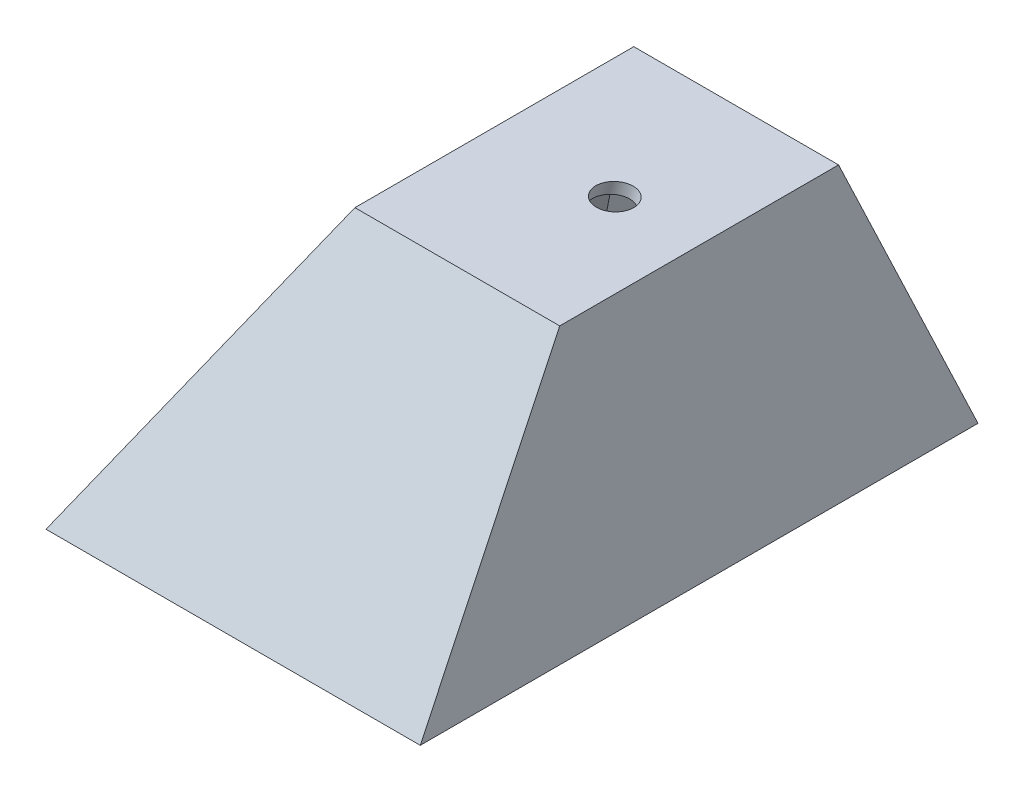
ISO-10303-21;
HEADER;
FILE_DESCRIPTION(('STEP AP214'),'2;1');
FILE_NAME('part.step','',(''),(''),'','','');
FILE_SCHEMA(('AUTOMOTIVE_DESIGN { 1 0 10303 214 1 1 1 1 }'));
ENDSEC;
DATA;
#1=APPLICATION_CONTEXT('core data for automotive mechanical design processes');
#2=APPLICATION_PROTOCOL_DEFINITION('international standard','automotive_design',2000,#1);
#3=PRODUCT_CONTEXT('',#1,'mechanical');
#4=PRODUCT('Part','Part','',(#3));
#5=PRODUCT_RELATED_PRODUCT_CATEGORY('part','',(#4));
#6=PRODUCT_DEFINITION_FORMATION('','',#4);
#7=PRODUCT_DEFINITION_CONTEXT('part definition',#1,'design');
#8=PRODUCT_DEFINITION('design','',#6,#7);
#9=PRODUCT_DEFINITION_SHAPE('','',#8);
#10=(LENGTH_UNIT() NAMED_UNIT(*) SI_UNIT(.MILLI.,.METRE.));
#11=(NAMED_UNIT(*) PLANE_ANGLE_UNIT() SI_UNIT($,.RADIAN.));
#12=(NAMED_UNIT(*) SI_UNIT($,.STERADIAN.) SOLID_ANGLE_UNIT());
#13=UNCERTAINTY_MEASURE_WITH_UNIT(LENGTH_MEASURE(1.E-05),#10,'distance_accuracy_value','');
#14=(GEOMETRIC_REPRESENTATION_CONTEXT(3) GLOBAL_UNCERTAINTY_ASSIGNED_CONTEXT((#13)) GLOBAL_UNIT_ASSIGNED_CONTEXT((#10,
#11,#12)) REPRESENTATION_CONTEXT('',''));
#15=CARTESIAN_POINT('',(0.,0.,0.));
#16=DIRECTION('',(0.,0.,1.));
#17=DIRECTION('',(1.,0.,0.));
#18=AXIS2_PLACEMENT_3D('',#15,#16,#17);
#19=CARTESIAN_POINT('',(0.,7.60993493538792,76.));
#20=DIRECTION('',(0.,-1.,0.));
#21=DIRECTION('',(1.,0.,0.));
#22=AXIS2_PLACEMENT_3D('',#19,#20,#21);
#23=PLANE('',#22);
#24=DIRECTION('',(0.,0.,-1.));
#25=VECTOR('',#24,1.);
#26=CARTESIAN_POINT('',(-16.4117509967115,7.60993493538792,76.));
#27=LINE('',#26,#25);
#28=CARTESIAN_POINT('',(-16.4117509967115,7.60993493538792,57.));
#29=VERTEX_POINT('',#28);
#30=CARTESIAN_POINT('',(-16.4117509967115,7.60993493538792,19.));
#31=VERTEX_POINT('',#30);
#32=EDGE_CURVE('E13',#29,#31,#27,.T.);
#33=ORIENTED_EDGE('',*,*,#32,.F.);
#34=DIRECTION('',(1.,0.,0.));
#35=VECTOR('',#34,1.);
#36=CARTESIAN_POINT('',(-39.5057617642968,7.60993493538793,57.));
#37=LINE('',#36,#35);
#38=CARTESIAN_POINT('',(11.4942382357032,7.60993493538793,57.));
#39=VERTEX_POINT('',#38);
#40=EDGE_CURVE('E155',#29,#39,#37,.T.);
#41=ORIENTED_EDGE('',*,*,#40,.T.);
#42=DIRECTION('',(0.,0.,-1.));
#43=VECTOR('',#42,1.);
#44=CARTESIAN_POINT('',(11.4942382357032,7.60993493538793,76.));
#45=LINE('',#44,#43);
#46=CARTESIAN_POINT('',(11.4942382357032,7.60993493538793,19.));
#47=VERTEX_POINT('',#46);
#48=EDGE_CURVE('E166',#39,#47,#45,.T.);
#49=ORIENTED_EDGE('',*,*,#48,.T.);
#50=DIRECTION('',(1.,0.,0.));
#51=VECTOR('',#50,1.);
#52=CARTESIAN_POINT('',(-39.5057617642968,7.60993493538793,19.));
#53=LINE('',#52,#51);
#54=EDGE_CURVE('E134',#31,#47,#53,.T.);
#55=ORIENTED_EDGE('',*,*,#54,.F.);
#56=EDGE_LOOP('',(#33,#41,#49,#55));
#57=FACE_BOUND('',#56,.T.);
#58=CARTESIAN_POINT('',(0.,7.60993493538793,38.));
#59=DIRECTION('',(0.,-1.,0.));
#60=DIRECTION('',(1.,0.,0.));
#61=AXIS2_PLACEMENT_3D('',#58,#59,#60);
#62=ELLIPSE('',#61,2.58819045102521,2.5);
#63=CARTESIAN_POINT('',(2.58819045102521,7.60993493538793,38.));
#64=VERTEX_POINT('',#63);
#65=EDGE_CURVE('E139',#64,#64,#62,.T.);
#66=ORIENTED_EDGE('',*,*,#65,.T.);
#67=EDGE_LOOP('',(#66));
#68=FACE_BOUND('',#67,.T.);
#69=ADVANCED_FACE('F46',(#57,#68),#23,.F.);
#70=CARTESIAN_POINT('',(0.,-32.3900650646121,76.));
#71=DIRECTION('',(0.,1.,0.));
#72=DIRECTION('',(0.,0.,1.));
#73=AXIS2_PLACEMENT_3D('',#70,#71,#72);
#74=PLANE('',#73);
#75=DIRECTION('',(1.,0.,0.));
#76=VECTOR('',#75,1.);
#77=CARTESIAN_POINT('',(0.,-32.3900650646121,0.));
#78=LINE('',#77,#76);
#79=CARTESIAN_POINT('',(-39.5057617642968,-32.3900650646121,0.));
#80=VERTEX_POINT('',#79);
#81=CARTESIAN_POINT('',(11.4942382357032,-32.3900650646121,0.));
#82=VERTEX_POINT('',#81);
#83=EDGE_CURVE('E163',#80,#82,#78,.T.);
#84=ORIENTED_EDGE('',*,*,#83,.T.);
#85=DIRECTION('',(0.,0.,-1.));
#86=VECTOR('',#85,1.);
#87=CARTESIAN_POINT('',(11.4942382357032,-32.3900650646121,76.));
#88=LINE('',#87,#86);
#89=CARTESIAN_POINT('',(11.4942382357032,-32.3900650646121,76.));
#90=VERTEX_POINT('',#89);
#91=EDGE_CURVE('E171',#90,#82,#88,.T.);
#92=ORIENTED_EDGE('',*,*,#91,.F.);
#93=DIRECTION('',(1.,0.,0.));
#94=VECTOR('',#93,1.);
#95=CARTESIAN_POINT('',(0.,-32.3900650646121,76.));
#96=LINE('',#95,#94);
#97=CARTESIAN_POINT('',(-39.5057617642968,-32.3900650646121,76.));
#98=VERTEX_POINT('',#97);
#99=EDGE_CURVE('E164',#98,#90,#96,.T.);
#100=ORIENTED_EDGE('',*,*,#99,.F.);
#101=DIRECTION('',(0.,0.,-1.));
#102=VECTOR('',#101,1.);
#103=CARTESIAN_POINT('',(-39.5057617642968,-32.3900650646121,76.));
#104=LINE('',#103,#102);
#105=EDGE_CURVE('E54',#98,#80,#104,.T.);
#106=ORIENTED_EDGE('',*,*,#105,.T.);
#107=EDGE_LOOP('',(#84,#92,#100,#106));
#108=FACE_BOUND('',#107,.T.);
#109=DIRECTION('',(1.,0.,0.));
#110=VECTOR('',#109,1.);
#111=CARTESIAN_POINT('',(0.,-32.3900650646121,1.93738910972989));
#112=LINE('',#111,#110);
#113=CARTESIAN_POINT('',(-37.4850358221331,-32.3900650646121,1.9373891097299));
#114=VERTEX_POINT('',#113);
#115=CARTESIAN_POINT('',(9.74423823570322,-32.3900650646121,1.9373891097299));
#116=VERTEX_POINT('',#115);
#117=EDGE_CURVE('E127',#114,#116,#112,.T.);
#118=ORIENTED_EDGE('',*,*,#117,.F.);
#119=DIRECTION('',(0.,0.,-1.));
#120=VECTOR('',#119,1.);
#121=CARTESIAN_POINT('',(-37.4850358221331,-32.3900650646121,76.));
#122=LINE('',#121,#120);
#123=CARTESIAN_POINT('',(-37.4850358221331,-32.3900650646121,74.0626108902701));
#124=VERTEX_POINT('',#123);
#125=EDGE_CURVE('E132',#124,#114,#122,.T.);
#126=ORIENTED_EDGE('',*,*,#125,.F.);
#127=DIRECTION('',(1.,0.,0.));
#128=VECTOR('',#127,1.);
#129=CARTESIAN_POINT('',(-39.5057617642968,-32.3900650646121,74.0626108902701));
#130=LINE('',#129,#128);
#131=CARTESIAN_POINT('',(9.74423823570322,-32.3900650646121,74.0626108902701));
#132=VERTEX_POINT('',#131);
#133=EDGE_CURVE('E61',#124,#132,#130,.T.);
#134=ORIENTED_EDGE('',*,*,#133,.T.);
#135=DIRECTION('',(0.,0.,-1.));
#136=VECTOR('',#135,1.);
#137=CARTESIAN_POINT('',(9.74423823570322,-32.3900650646121,76.));
#138=LINE('',#137,#136);
#139=EDGE_CURVE('E136',#132,#116,#138,.T.);
#140=ORIENTED_EDGE('',*,*,#139,.T.);
#141=EDGE_LOOP('',(#118,#126,#134,#140));
#142=FACE_BOUND('',#141,.T.);
#143=ADVANCED_FACE('F177',(#108,#142),#74,.F.);
#144=CARTESIAN_POINT('',(-15.6040117351299,9.00898037571542,76.));
#145=DIRECTION('',(0.866025403784436,-0.500000000000004,0.));
#146=DIRECTION('',(0.500000000000004,0.866025403784436,0.));
#147=AXIS2_PLACEMENT_3D('',#144,#145,#146);
#148=PLANE('',#147);
#149=ORIENTED_EDGE('',*,*,#105,.F.);
#150=DIRECTION('',(0.462404571169227,0.800908210917192,-0.380431400185666));
#151=VECTOR('',#150,1.);
#152=CARTESIAN_POINT('',(-19.0632654143478,3.01737724704049,59.181464901965));
#153=LINE('',#152,#151);
#154=EDGE_CURVE('E70',#98,#29,#153,.T.);
#155=ORIENTED_EDGE('',*,*,#154,.T.);
#156=ORIENTED_EDGE('',*,*,#32,.T.);
#157=DIRECTION('',(-0.462404571169227,-0.800908210917192,-0.380431400185666));
#158=VECTOR('',#157,1.);
#159=CARTESIAN_POINT('',(-5.69386081122353,26.1738652865967,27.8178669168242));
#160=LINE('',#159,#158);
#161=EDGE_CURVE('E157',#31,#80,#160,.T.);
#162=ORIENTED_EDGE('',*,*,#161,.T.);
#163=EDGE_LOOP('',(#149,#155,#156,#162));
#164=FACE_BOUND('',#163,.T.);
#165=ADVANCED_FACE('F181',(#164),#148,.F.);
#166=CARTESIAN_POINT('',(11.4942382357032,0.,76.));
#167=DIRECTION('',(-1.,0.,0.));
#168=DIRECTION('',(0.,0.,1.));
#169=AXIS2_PLACEMENT_3D('',#166,#167,#168);
#170=PLANE('',#169);
#171=ORIENTED_EDGE('',*,*,#48,.F.);
#172=DIRECTION('',(0.,0.90327750435429,-0.429056814568288));
#173=VECTOR('',#172,1.);
#174=CARTESIAN_POINT('',(11.4942382357032,7.60993493538793,57.));
#175=LINE('',#174,#173);
#176=EDGE_CURVE('E153',#90,#39,#175,.T.);
#177=ORIENTED_EDGE('',*,*,#176,.F.);
#178=ORIENTED_EDGE('',*,*,#91,.T.);
#179=DIRECTION('',(0.,-0.90327750435429,-0.429056814568288));
#180=VECTOR('',#179,1.);
#181=CARTESIAN_POINT('',(11.4942382357032,7.60993493538793,19.));
#182=LINE('',#181,#180);
#183=EDGE_CURVE('E131',#47,#82,#182,.T.);
#184=ORIENTED_EDGE('',*,*,#183,.F.);
#185=EDGE_LOOP('',(#171,#177,#178,#184));
#186=FACE_BOUND('',#185,.T.);
#187=ADVANCED_FACE('F192',(#186),#170,.F.);
#188=CARTESIAN_POINT('',(-39.5057617642968,7.60993493538793,19.));
#189=DIRECTION('',(0.,-0.429056814568288,0.90327750435429));
#190=DIRECTION('',(0.,-0.90327750435429,-0.429056814568288));
#191=AXIS2_PLACEMENT_3D('',#188,#189,#190);
#192=PLANE('',#191);
#193=ORIENTED_EDGE('',*,*,#54,.T.);
#194=ORIENTED_EDGE('',*,*,#183,.T.);
#195=ORIENTED_EDGE('',*,*,#83,.F.);
#196=ORIENTED_EDGE('',*,*,#161,.F.);
#197=EDGE_LOOP('',(#193,#194,#195,#196));
#198=FACE_BOUND('',#197,.T.);
#199=ADVANCED_FACE('F185',(#198),#192,.F.);
#200=CARTESIAN_POINT('',(-39.5057617642968,7.60993493538793,57.));
#201=DIRECTION('',(0.,-0.429056814568288,-0.90327750435429));
#202=DIRECTION('',(0.,0.90327750435429,-0.429056814568288));
#203=AXIS2_PLACEMENT_3D('',#200,#201,#202);
#204=PLANE('',#203);
#205=ORIENTED_EDGE('',*,*,#99,.T.);
#206=ORIENTED_EDGE('',*,*,#176,.T.);
#207=ORIENTED_EDGE('',*,*,#40,.F.);
#208=ORIENTED_EDGE('',*,*,#154,.F.);
#209=EDGE_LOOP('',(#205,#206,#207,#208));
#210=FACE_BOUND('',#209,.T.);
#211=ADVANCED_FACE('F193',(#210),#204,.F.);
#212=CARTESIAN_POINT('',(0.,5.85993493538792,76.));
#213=DIRECTION('',(0.,-1.,0.));
#214=DIRECTION('',(1.,0.,0.));
#215=AXIS2_PLACEMENT_3D('',#212,#213,#214);
#216=PLANE('',#215);
#217=CARTESIAN_POINT('',(-0.468911086754471,5.85993493538792,38.));
#218=DIRECTION('',(0.,-1.,0.));
#219=DIRECTION('',(1.,0.,0.));
#220=AXIS2_PLACEMENT_3D('',#217,#218,#219);
#221=ELLIPSE('',#220,2.58819045102521,2.5);
#222=CARTESIAN_POINT('',(2.11927936427074,5.85993493538792,38.));
#223=VERTEX_POINT('',#222);
#224=EDGE_CURVE('E49',#223,#223,#221,.T.);
#225=ORIENTED_EDGE('',*,*,#224,.F.);
#226=EDGE_LOOP('',(#225));
#227=FACE_BOUND('',#226,.T.);
#228=DIRECTION('',(0.,0.,-1.));
#229=VECTOR('',#228,1.);
#230=CARTESIAN_POINT('',(-15.4013880256297,5.85993493538792,76.));
#231=LINE('',#230,#229);
#232=CARTESIAN_POINT('',(-15.4013880256297,5.85993493538792,55.8938608902701));
#233=VERTEX_POINT('',#232);
#234=CARTESIAN_POINT('',(-15.4013880256297,5.85993493538792,20.1061391097299));
#235=VERTEX_POINT('',#234);
#236=EDGE_CURVE('E116',#233,#235,#231,.T.);
#237=ORIENTED_EDGE('',*,*,#236,.T.);
#238=DIRECTION('',(1.,0.,0.));
#239=VECTOR('',#238,1.);
#240=CARTESIAN_POINT('',(-39.5057617642968,5.85993493538792,20.1061391097299));
#241=LINE('',#240,#239);
#242=CARTESIAN_POINT('',(9.74423823570322,5.85993493538793,20.1061391097299));
#243=VERTEX_POINT('',#242);
#244=EDGE_CURVE('E142',#235,#243,#241,.T.);
#245=ORIENTED_EDGE('',*,*,#244,.T.);
#246=DIRECTION('',(0.,0.,-1.));
#247=VECTOR('',#246,1.);
#248=CARTESIAN_POINT('',(9.74423823570322,5.85993493538793,76.));
#249=LINE('',#248,#247);
#250=CARTESIAN_POINT('',(9.74423823570322,5.85993493538793,55.8938608902701));
#251=VERTEX_POINT('',#250);
#252=EDGE_CURVE('E118',#251,#243,#249,.T.);
#253=ORIENTED_EDGE('',*,*,#252,.F.);
#254=DIRECTION('',(1.,0.,0.));
#255=VECTOR('',#254,1.);
#256=CARTESIAN_POINT('',(0.,5.85993493538792,55.8938608902701));
#257=LINE('',#256,#255);
#258=EDGE_CURVE('E113',#233,#251,#257,.T.);
#259=ORIENTED_EDGE('',*,*,#258,.F.);
#260=EDGE_LOOP('',(#237,#245,#253,#259));
#261=FACE_BOUND('',#260,.T.);
#262=ADVANCED_FACE('F114',(#227,#261),#216,.T.);
#263=CARTESIAN_POINT('',(-14.0884672785071,8.13398037571541,76.));
#264=DIRECTION('',(0.866025403784436,-0.500000000000004,0.));
#265=DIRECTION('',(0.500000000000004,0.866025403784436,0.));
#266=AXIS2_PLACEMENT_3D('',#263,#264,#265);
#267=PLANE('',#266);
#268=ORIENTED_EDGE('',*,*,#125,.T.);
#269=DIRECTION('',(-0.462404571169227,-0.800908210917192,-0.380431400185666));
#270=VECTOR('',#269,1.);
#271=CARTESIAN_POINT('',(-4.44601477688356,24.8351980180969,29.1193890740167));
#272=LINE('',#271,#270);
#273=EDGE_CURVE('E119',#235,#114,#272,.T.);
#274=ORIENTED_EDGE('',*,*,#273,.F.);
#275=ORIENTED_EDGE('',*,*,#236,.F.);
#276=DIRECTION('',(0.462404571169227,0.800908210917192,-0.380431400185666));
#277=VECTOR('',#276,1.);
#278=CARTESIAN_POINT('',(-17.8154193800078,1.67870997854067,57.8799427447725));
#279=LINE('',#278,#277);
#280=EDGE_CURVE('E122',#124,#233,#279,.T.);
#281=ORIENTED_EDGE('',*,*,#280,.F.);
#282=EDGE_LOOP('',(#268,#274,#275,#281));
#283=FACE_BOUND('',#282,.T.);
#284=ADVANCED_FACE('F129',(#283),#267,.T.);
#285=CARTESIAN_POINT('',(9.74423823570322,0.,76.));
#286=DIRECTION('',(-1.,0.,0.));
#287=DIRECTION('',(0.,0.,1.));
#288=AXIS2_PLACEMENT_3D('',#285,#286,#287);
#289=PLANE('',#288);
#290=ORIENTED_EDGE('',*,*,#252,.T.);
#291=DIRECTION('',(0.,-0.90327750435429,-0.429056814568288));
#292=VECTOR('',#291,1.);
#293=CARTESIAN_POINT('',(9.74423823570322,6.85908550989342,20.58073563262));
#294=LINE('',#293,#292);
#295=EDGE_CURVE('E143',#243,#116,#294,.T.);
#296=ORIENTED_EDGE('',*,*,#295,.T.);
#297=ORIENTED_EDGE('',*,*,#139,.F.);
#298=DIRECTION('',(0.,0.90327750435429,-0.429056814568288));
#299=VECTOR('',#298,1.);
#300=CARTESIAN_POINT('',(9.74423823570322,6.85908550989342,55.41926436738));
#301=LINE('',#300,#299);
#302=EDGE_CURVE('E120',#132,#251,#301,.T.);
#303=ORIENTED_EDGE('',*,*,#302,.T.);
#304=EDGE_LOOP('',(#290,#296,#297,#303));
#305=FACE_BOUND('',#304,.T.);
#306=ADVANCED_FACE('F240',(#305),#289,.T.);
#307=CARTESIAN_POINT('',(-39.5057617642968,6.85908550989342,20.58073563262));
#308=DIRECTION('',(0.,-0.429056814568288,0.90327750435429));
#309=DIRECTION('',(0.,-0.90327750435429,-0.429056814568288));
#310=AXIS2_PLACEMENT_3D('',#307,#308,#309);
#311=PLANE('',#310);
#312=ORIENTED_EDGE('',*,*,#244,.F.);
#313=ORIENTED_EDGE('',*,*,#273,.T.);
#314=ORIENTED_EDGE('',*,*,#117,.T.);
#315=ORIENTED_EDGE('',*,*,#295,.F.);
#316=EDGE_LOOP('',(#312,#313,#314,#315));
#317=FACE_BOUND('',#316,.T.);
#318=ADVANCED_FACE('F251',(#317),#311,.T.);
#319=CARTESIAN_POINT('',(-39.5057617642968,6.85908550989342,55.41926436738));
#320=DIRECTION('',(0.,-0.429056814568288,-0.90327750435429));
#321=DIRECTION('',(0.,0.90327750435429,-0.429056814568288));
#322=AXIS2_PLACEMENT_3D('',#319,#320,#321);
#323=PLANE('',#322);
#324=ORIENTED_EDGE('',*,*,#133,.F.);
#325=ORIENTED_EDGE('',*,*,#280,.T.);
#326=ORIENTED_EDGE('',*,*,#258,.T.);
#327=ORIENTED_EDGE('',*,*,#302,.F.);
#328=EDGE_LOOP('',(#324,#325,#326,#327));
#329=FACE_BOUND('',#328,.T.);
#330=ADVANCED_FACE('F123',(#329),#323,.T.);
#331=CARTESIAN_POINT('',(-12.64638424028,-39.5870135813751,38.));
#332=DIRECTION('',(0.258819045102523,0.965925826289068,0.));
#333=DIRECTION('',(-0.965925826289068,0.258819045102523,0.));
#334=AXIS2_PLACEMENT_3D('',#331,#332,#333);
#335=CYLINDRICAL_SURFACE('',#334,2.5);
#336=ORIENTED_EDGE('',*,*,#224,.T.);
#337=EDGE_LOOP('',(#336));
#338=FACE_BOUND('',#337,.T.);
#339=ORIENTED_EDGE('',*,*,#65,.F.);
#340=EDGE_LOOP('',(#339));
#341=FACE_BOUND('',#340,.T.);
#342=ADVANCED_FACE('F270',(#338,#341),#335,.F.);
#343=CLOSED_SHELL('',(#69,#143,#165,#187,#199,#211,#262,#284,#306,#318,#330,#342));
#344=MANIFOLD_SOLID_BREP('B2',#343);
#345=ADVANCED_BREP_SHAPE_REPRESENTATION('',(#18,#344),#14);
#346=SHAPE_DEFINITION_REPRESENTATION(#9,#345);
ENDSEC;
END-ISO-10303-21;
